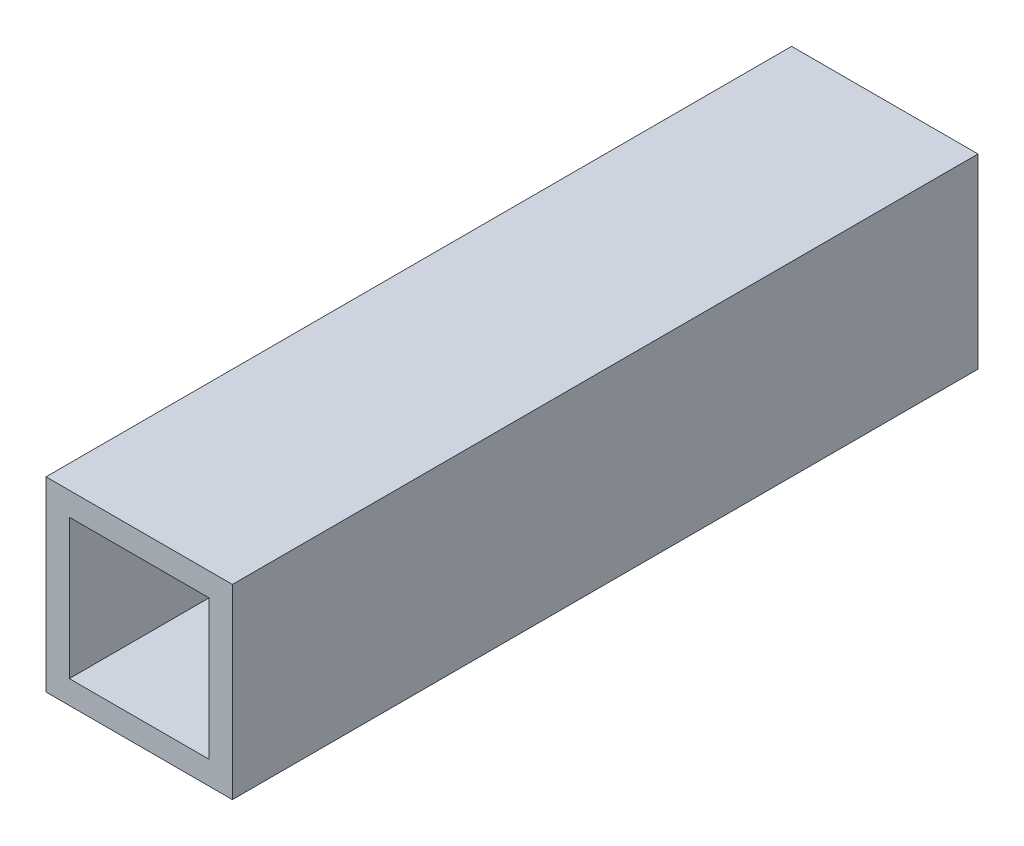
ISO-10303-21;
HEADER;
FILE_DESCRIPTION(('STEP AP214'),'2;1');
FILE_NAME('part.step','',(''),(''),'','','');
FILE_SCHEMA(('AUTOMOTIVE_DESIGN { 1 0 10303 214 1 1 1 1 }'));
ENDSEC;
DATA;
#1=APPLICATION_CONTEXT('core data for automotive mechanical design processes');
#2=APPLICATION_PROTOCOL_DEFINITION('international standard','automotive_design',2000,#1);
#3=PRODUCT_CONTEXT('',#1,'mechanical');
#4=PRODUCT('Part','Part','',(#3));
#5=PRODUCT_RELATED_PRODUCT_CATEGORY('part','',(#4));
#6=PRODUCT_DEFINITION_FORMATION('','',#4);
#7=PRODUCT_DEFINITION_CONTEXT('part definition',#1,'design');
#8=PRODUCT_DEFINITION('design','',#6,#7);
#9=PRODUCT_DEFINITION_SHAPE('','',#8);
#10=(LENGTH_UNIT() NAMED_UNIT(*) SI_UNIT(.MILLI.,.METRE.));
#11=(NAMED_UNIT(*) PLANE_ANGLE_UNIT() SI_UNIT($,.RADIAN.));
#12=(NAMED_UNIT(*) SI_UNIT($,.STERADIAN.) SOLID_ANGLE_UNIT());
#13=UNCERTAINTY_MEASURE_WITH_UNIT(LENGTH_MEASURE(1.E-05),#10,'distance_accuracy_value','');
#14=(GEOMETRIC_REPRESENTATION_CONTEXT(3) GLOBAL_UNCERTAINTY_ASSIGNED_CONTEXT((#13)) GLOBAL_UNIT_ASSIGNED_CONTEXT((#10,
#11,#12)) REPRESENTATION_CONTEXT('',''));
#15=CARTESIAN_POINT('',(0.,0.,0.));
#16=DIRECTION('',(0.,0.,1.));
#17=DIRECTION('',(1.,0.,0.));
#18=AXIS2_PLACEMENT_3D('',#15,#16,#17);
#19=CARTESIAN_POINT('',(0.,0.,101.6));
#20=DIRECTION('',(0.,0.,-1.));
#21=DIRECTION('',(-1.,0.,0.));
#22=AXIS2_PLACEMENT_3D('',#19,#20,#21);
#23=PLANE('',#22);
#24=DIRECTION('',(0.,-1.,0.));
#25=VECTOR('',#24,1.);
#26=CARTESIAN_POINT('',(-12.7,-12.7,101.6));
#27=LINE('',#26,#25);
#28=CARTESIAN_POINT('',(-12.7,12.7,101.6));
#29=VERTEX_POINT('',#28);
#30=CARTESIAN_POINT('',(-12.7,-12.7,101.6));
#31=VERTEX_POINT('',#30);
#32=EDGE_CURVE('E138',#29,#31,#27,.T.);
#33=ORIENTED_EDGE('',*,*,#32,.T.);
#34=DIRECTION('',(1.,0.,0.));
#35=VECTOR('',#34,1.);
#36=CARTESIAN_POINT('',(-12.7,-12.7,101.6));
#37=LINE('',#36,#35);
#38=CARTESIAN_POINT('',(12.7,-12.7,101.6));
#39=VERTEX_POINT('',#38);
#40=EDGE_CURVE('E141',#31,#39,#37,.T.);
#41=ORIENTED_EDGE('',*,*,#40,.T.);
#42=DIRECTION('',(0.,1.,0.));
#43=VECTOR('',#42,1.);
#44=CARTESIAN_POINT('',(12.7,-12.7,101.6));
#45=LINE('',#44,#43);
#46=CARTESIAN_POINT('',(12.7,12.7,101.6));
#47=VERTEX_POINT('',#46);
#48=EDGE_CURVE('E144',#39,#47,#45,.T.);
#49=ORIENTED_EDGE('',*,*,#48,.T.);
#50=DIRECTION('',(-1.,0.,0.));
#51=VECTOR('',#50,1.);
#52=CARTESIAN_POINT('',(-12.7,12.7,101.6));
#53=LINE('',#52,#51);
#54=EDGE_CURVE('E146',#47,#29,#53,.T.);
#55=ORIENTED_EDGE('',*,*,#54,.T.);
#56=EDGE_LOOP('',(#33,#41,#49,#55));
#57=FACE_BOUND('',#56,.T.);
#58=DIRECTION('',(0.,1.,0.));
#59=VECTOR('',#58,1.);
#60=CARTESIAN_POINT('',(9.525,-9.525,101.6));
#61=LINE('',#60,#59);
#62=CARTESIAN_POINT('',(9.525,-9.525,101.6));
#63=VERTEX_POINT('',#62);
#64=CARTESIAN_POINT('',(9.525,9.525,101.6));
#65=VERTEX_POINT('',#64);
#66=EDGE_CURVE('E102',#63,#65,#61,.T.);
#67=ORIENTED_EDGE('',*,*,#66,.F.);
#68=DIRECTION('',(1.,0.,0.));
#69=VECTOR('',#68,1.);
#70=CARTESIAN_POINT('',(-9.525,-9.525,101.6));
#71=LINE('',#70,#69);
#72=CARTESIAN_POINT('',(-9.525,-9.525,101.6));
#73=VERTEX_POINT('',#72);
#74=EDGE_CURVE('E124',#73,#63,#71,.T.);
#75=ORIENTED_EDGE('',*,*,#74,.F.);
#76=DIRECTION('',(0.,-1.,0.));
#77=VECTOR('',#76,1.);
#78=CARTESIAN_POINT('',(-9.525,-9.525,101.6));
#79=LINE('',#78,#77);
#80=CARTESIAN_POINT('',(-9.525,9.525,101.6));
#81=VERTEX_POINT('',#80);
#82=EDGE_CURVE('E122',#81,#73,#79,.T.);
#83=ORIENTED_EDGE('',*,*,#82,.F.);
#84=DIRECTION('',(-1.,0.,0.));
#85=VECTOR('',#84,1.);
#86=CARTESIAN_POINT('',(-9.525,9.525,101.6));
#87=LINE('',#86,#85);
#88=EDGE_CURVE('E110',#65,#81,#87,.T.);
#89=ORIENTED_EDGE('',*,*,#88,.F.);
#90=EDGE_LOOP('',(#67,#75,#83,#89));
#91=FACE_BOUND('',#90,.T.);
#92=ADVANCED_FACE('F37',(#57,#91),#23,.F.);
#93=CARTESIAN_POINT('',(0.,0.,0.));
#94=DIRECTION('',(0.,0.,-1.));
#95=DIRECTION('',(-1.,0.,0.));
#96=AXIS2_PLACEMENT_3D('',#93,#94,#95);
#97=PLANE('',#96);
#98=DIRECTION('',(0.,-1.,0.));
#99=VECTOR('',#98,1.);
#100=CARTESIAN_POINT('',(-12.7,-12.7,0.));
#101=LINE('',#100,#99);
#102=CARTESIAN_POINT('',(-12.7,12.7,0.));
#103=VERTEX_POINT('',#102);
#104=CARTESIAN_POINT('',(-12.7,-12.7,0.));
#105=VERTEX_POINT('',#104);
#106=EDGE_CURVE('E118',#103,#105,#101,.T.);
#107=ORIENTED_EDGE('',*,*,#106,.F.);
#108=DIRECTION('',(-1.,0.,0.));
#109=VECTOR('',#108,1.);
#110=CARTESIAN_POINT('',(-12.7,12.7,0.));
#111=LINE('',#110,#109);
#112=CARTESIAN_POINT('',(12.7,12.7,0.));
#113=VERTEX_POINT('',#112);
#114=EDGE_CURVE('E142',#113,#103,#111,.T.);
#115=ORIENTED_EDGE('',*,*,#114,.F.);
#116=DIRECTION('',(0.,1.,0.));
#117=VECTOR('',#116,1.);
#118=CARTESIAN_POINT('',(12.7,-12.7,0.));
#119=LINE('',#118,#117);
#120=CARTESIAN_POINT('',(12.7,-12.7,0.));
#121=VERTEX_POINT('',#120);
#122=EDGE_CURVE('E153',#121,#113,#119,.T.);
#123=ORIENTED_EDGE('',*,*,#122,.F.);
#124=DIRECTION('',(1.,0.,0.));
#125=VECTOR('',#124,1.);
#126=CARTESIAN_POINT('',(-12.7,-12.7,0.));
#127=LINE('',#126,#125);
#128=EDGE_CURVE('E151',#105,#121,#127,.T.);
#129=ORIENTED_EDGE('',*,*,#128,.F.);
#130=EDGE_LOOP('',(#107,#115,#123,#129));
#131=FACE_BOUND('',#130,.T.);
#132=DIRECTION('',(1.,0.,0.));
#133=VECTOR('',#132,1.);
#134=CARTESIAN_POINT('',(-9.525,-9.525,0.));
#135=LINE('',#134,#133);
#136=CARTESIAN_POINT('',(-9.525,-9.525,0.));
#137=VERTEX_POINT('',#136);
#138=CARTESIAN_POINT('',(9.525,-9.525,0.));
#139=VERTEX_POINT('',#138);
#140=EDGE_CURVE('E111',#137,#139,#135,.T.);
#141=ORIENTED_EDGE('',*,*,#140,.T.);
#142=DIRECTION('',(0.,1.,0.));
#143=VECTOR('',#142,1.);
#144=CARTESIAN_POINT('',(9.525,-9.525,0.));
#145=LINE('',#144,#143);
#146=CARTESIAN_POINT('',(9.525,9.525,0.));
#147=VERTEX_POINT('',#146);
#148=EDGE_CURVE('E60',#139,#147,#145,.T.);
#149=ORIENTED_EDGE('',*,*,#148,.T.);
#150=DIRECTION('',(-1.,0.,0.));
#151=VECTOR('',#150,1.);
#152=CARTESIAN_POINT('',(-9.525,9.525,0.));
#153=LINE('',#152,#151);
#154=CARTESIAN_POINT('',(-9.525,9.525,0.));
#155=VERTEX_POINT('',#154);
#156=EDGE_CURVE('E117',#147,#155,#153,.T.);
#157=ORIENTED_EDGE('',*,*,#156,.T.);
#158=DIRECTION('',(0.,-1.,0.));
#159=VECTOR('',#158,1.);
#160=CARTESIAN_POINT('',(-9.525,-9.525,0.));
#161=LINE('',#160,#159);
#162=EDGE_CURVE('E130',#155,#137,#161,.T.);
#163=ORIENTED_EDGE('',*,*,#162,.T.);
#164=EDGE_LOOP('',(#141,#149,#157,#163));
#165=FACE_BOUND('',#164,.T.);
#166=ADVANCED_FACE('F171',(#131,#165),#97,.T.);
#167=CARTESIAN_POINT('',(-12.7,-12.7,101.6));
#168=DIRECTION('',(1.,0.,0.));
#169=DIRECTION('',(0.,1.,0.));
#170=AXIS2_PLACEMENT_3D('',#167,#168,#169);
#171=PLANE('',#170);
#172=ORIENTED_EDGE('',*,*,#106,.T.);
#173=DIRECTION('',(0.,0.,-1.));
#174=VECTOR('',#173,1.);
#175=CARTESIAN_POINT('',(-12.7,-12.7,101.6));
#176=LINE('',#175,#174);
#177=EDGE_CURVE('E11',#31,#105,#176,.T.);
#178=ORIENTED_EDGE('',*,*,#177,.F.);
#179=ORIENTED_EDGE('',*,*,#32,.F.);
#180=DIRECTION('',(0.,0.,-1.));
#181=VECTOR('',#180,1.);
#182=CARTESIAN_POINT('',(-12.7,12.7,101.6));
#183=LINE('',#182,#181);
#184=EDGE_CURVE('E148',#29,#103,#183,.T.);
#185=ORIENTED_EDGE('',*,*,#184,.T.);
#186=EDGE_LOOP('',(#172,#178,#179,#185));
#187=FACE_BOUND('',#186,.T.);
#188=ADVANCED_FACE('F39',(#187),#171,.F.);
#189=CARTESIAN_POINT('',(-12.7,-12.7,101.6));
#190=DIRECTION('',(0.,1.,0.));
#191=DIRECTION('',(-1.,0.,0.));
#192=AXIS2_PLACEMENT_3D('',#189,#190,#191);
#193=PLANE('',#192);
#194=ORIENTED_EDGE('',*,*,#128,.T.);
#195=DIRECTION('',(0.,0.,-1.));
#196=VECTOR('',#195,1.);
#197=CARTESIAN_POINT('',(12.7,-12.7,101.6));
#198=LINE('',#197,#196);
#199=EDGE_CURVE('E45',#39,#121,#198,.T.);
#200=ORIENTED_EDGE('',*,*,#199,.F.);
#201=ORIENTED_EDGE('',*,*,#40,.F.);
#202=ORIENTED_EDGE('',*,*,#177,.T.);
#203=EDGE_LOOP('',(#194,#200,#201,#202));
#204=FACE_BOUND('',#203,.T.);
#205=ADVANCED_FACE('F181',(#204),#193,.F.);
#206=CARTESIAN_POINT('',(12.7,-12.7,101.6));
#207=DIRECTION('',(-1.,0.,0.));
#208=DIRECTION('',(0.,-1.,0.));
#209=AXIS2_PLACEMENT_3D('',#206,#207,#208);
#210=PLANE('',#209);
#211=ORIENTED_EDGE('',*,*,#122,.T.);
#212=DIRECTION('',(0.,0.,-1.));
#213=VECTOR('',#212,1.);
#214=CARTESIAN_POINT('',(12.7,12.7,101.6));
#215=LINE('',#214,#213);
#216=EDGE_CURVE('E158',#47,#113,#215,.T.);
#217=ORIENTED_EDGE('',*,*,#216,.F.);
#218=ORIENTED_EDGE('',*,*,#48,.F.);
#219=ORIENTED_EDGE('',*,*,#199,.T.);
#220=EDGE_LOOP('',(#211,#217,#218,#219));
#221=FACE_BOUND('',#220,.T.);
#222=ADVANCED_FACE('F165',(#221),#210,.F.);
#223=CARTESIAN_POINT('',(-12.7,12.7,101.6));
#224=DIRECTION('',(0.,-1.,0.));
#225=DIRECTION('',(1.,0.,0.));
#226=AXIS2_PLACEMENT_3D('',#223,#224,#225);
#227=PLANE('',#226);
#228=ORIENTED_EDGE('',*,*,#114,.T.);
#229=ORIENTED_EDGE('',*,*,#184,.F.);
#230=ORIENTED_EDGE('',*,*,#54,.F.);
#231=ORIENTED_EDGE('',*,*,#216,.T.);
#232=EDGE_LOOP('',(#228,#229,#230,#231));
#233=FACE_BOUND('',#232,.T.);
#234=ADVANCED_FACE('F175',(#233),#227,.F.);
#235=CARTESIAN_POINT('',(9.525,-9.525,101.6));
#236=DIRECTION('',(-1.,0.,0.));
#237=DIRECTION('',(0.,0.,1.));
#238=AXIS2_PLACEMENT_3D('',#235,#236,#237);
#239=PLANE('',#238);
#240=ORIENTED_EDGE('',*,*,#148,.F.);
#241=DIRECTION('',(0.,0.,-1.));
#242=VECTOR('',#241,1.);
#243=CARTESIAN_POINT('',(9.525,-9.525,101.6));
#244=LINE('',#243,#242);
#245=EDGE_CURVE('E106',#63,#139,#244,.T.);
#246=ORIENTED_EDGE('',*,*,#245,.F.);
#247=ORIENTED_EDGE('',*,*,#66,.T.);
#248=DIRECTION('',(0.,0.,-1.));
#249=VECTOR('',#248,1.);
#250=CARTESIAN_POINT('',(9.525,9.525,101.6));
#251=LINE('',#250,#249);
#252=EDGE_CURVE('E105',#65,#147,#251,.T.);
#253=ORIENTED_EDGE('',*,*,#252,.T.);
#254=EDGE_LOOP('',(#240,#246,#247,#253));
#255=FACE_BOUND('',#254,.T.);
#256=ADVANCED_FACE('F104',(#255),#239,.T.);
#257=CARTESIAN_POINT('',(-9.525,9.525,101.6));
#258=DIRECTION('',(0.,-1.,0.));
#259=DIRECTION('',(0.,0.,-1.));
#260=AXIS2_PLACEMENT_3D('',#257,#258,#259);
#261=PLANE('',#260);
#262=ORIENTED_EDGE('',*,*,#156,.F.);
#263=ORIENTED_EDGE('',*,*,#252,.F.);
#264=ORIENTED_EDGE('',*,*,#88,.T.);
#265=DIRECTION('',(0.,0.,-1.));
#266=VECTOR('',#265,1.);
#267=CARTESIAN_POINT('',(-9.525,9.525,101.6));
#268=LINE('',#267,#266);
#269=EDGE_CURVE('E119',#81,#155,#268,.T.);
#270=ORIENTED_EDGE('',*,*,#269,.T.);
#271=EDGE_LOOP('',(#262,#263,#264,#270));
#272=FACE_BOUND('',#271,.T.);
#273=ADVANCED_FACE('F114',(#272),#261,.T.);
#274=CARTESIAN_POINT('',(-9.525,-9.525,101.6));
#275=DIRECTION('',(1.,0.,0.));
#276=DIRECTION('',(0.,0.,-1.));
#277=AXIS2_PLACEMENT_3D('',#274,#275,#276);
#278=PLANE('',#277);
#279=ORIENTED_EDGE('',*,*,#162,.F.);
#280=ORIENTED_EDGE('',*,*,#269,.F.);
#281=ORIENTED_EDGE('',*,*,#82,.T.);
#282=DIRECTION('',(0.,0.,-1.));
#283=VECTOR('',#282,1.);
#284=CARTESIAN_POINT('',(-9.525,-9.525,101.6));
#285=LINE('',#284,#283);
#286=EDGE_CURVE('E52',#73,#137,#285,.T.);
#287=ORIENTED_EDGE('',*,*,#286,.T.);
#288=EDGE_LOOP('',(#279,#280,#281,#287));
#289=FACE_BOUND('',#288,.T.);
#290=ADVANCED_FACE('F204',(#289),#278,.T.);
#291=CARTESIAN_POINT('',(-9.525,-9.525,101.6));
#292=DIRECTION('',(0.,1.,0.));
#293=DIRECTION('',(0.,0.,1.));
#294=AXIS2_PLACEMENT_3D('',#291,#292,#293);
#295=PLANE('',#294);
#296=ORIENTED_EDGE('',*,*,#140,.F.);
#297=ORIENTED_EDGE('',*,*,#286,.F.);
#298=ORIENTED_EDGE('',*,*,#74,.T.);
#299=ORIENTED_EDGE('',*,*,#245,.T.);
#300=EDGE_LOOP('',(#296,#297,#298,#299));
#301=FACE_BOUND('',#300,.T.);
#302=ADVANCED_FACE('F208',(#301),#295,.T.);
#303=CLOSED_SHELL('',(#92,#166,#188,#205,#222,#234,#256,#273,#290,#302));
#304=MANIFOLD_SOLID_BREP('B2',#303);
#305=ADVANCED_BREP_SHAPE_REPRESENTATION('',(#18,#304),#14);
#306=SHAPE_DEFINITION_REPRESENTATION(#9,#305);
ENDSEC;
END-ISO-10303-21;
